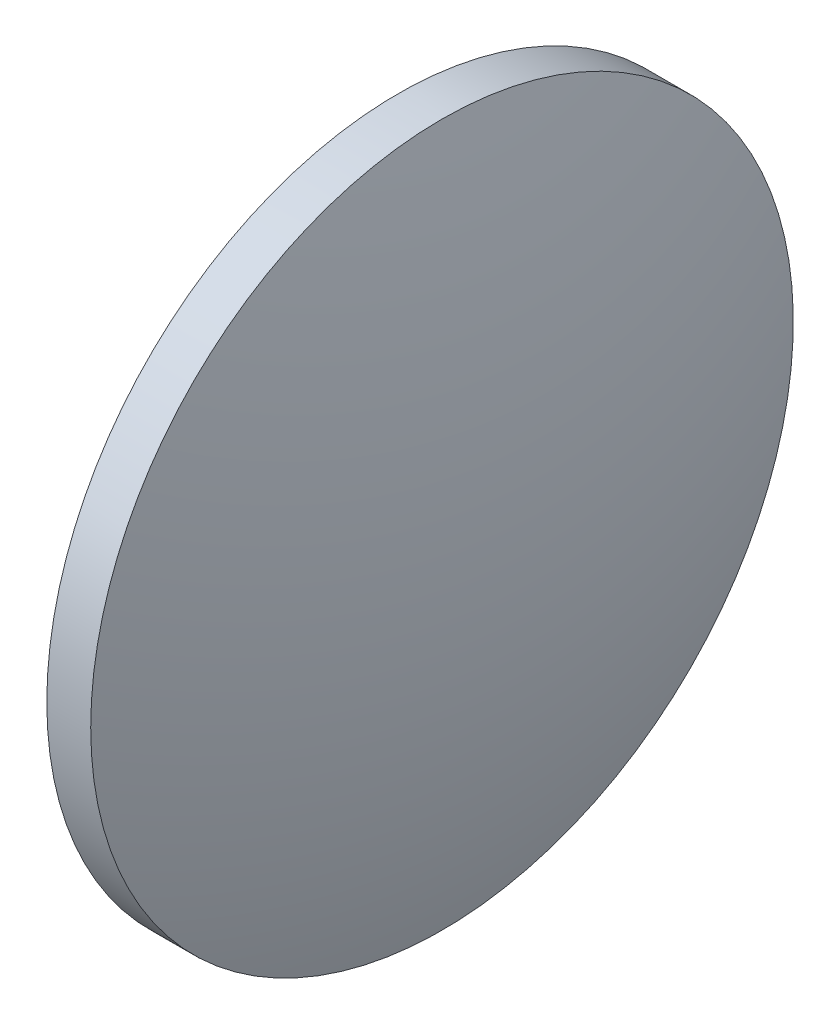
ISO-10303-21;
HEADER;
FILE_DESCRIPTION(('STEP AP214'),'2;1');
FILE_NAME('part.step','',(''),(''),'','','');
FILE_SCHEMA(('AUTOMOTIVE_DESIGN { 1 0 10303 214 1 1 1 1 }'));
ENDSEC;
DATA;
#1=APPLICATION_CONTEXT('core data for automotive mechanical design processes');
#2=APPLICATION_PROTOCOL_DEFINITION('international standard','automotive_design',2000,#1);
#3=PRODUCT_CONTEXT('',#1,'mechanical');
#4=PRODUCT('Part','Part','',(#3));
#5=PRODUCT_RELATED_PRODUCT_CATEGORY('part','',(#4));
#6=PRODUCT_DEFINITION_FORMATION('','',#4);
#7=PRODUCT_DEFINITION_CONTEXT('part definition',#1,'design');
#8=PRODUCT_DEFINITION('design','',#6,#7);
#9=PRODUCT_DEFINITION_SHAPE('','',#8);
#10=(LENGTH_UNIT() NAMED_UNIT(*) SI_UNIT(.MILLI.,.METRE.));
#11=(NAMED_UNIT(*) PLANE_ANGLE_UNIT() SI_UNIT($,.RADIAN.));
#12=(NAMED_UNIT(*) SI_UNIT($,.STERADIAN.) SOLID_ANGLE_UNIT());
#13=UNCERTAINTY_MEASURE_WITH_UNIT(LENGTH_MEASURE(1.E-05),#10,'distance_accuracy_value','');
#14=(GEOMETRIC_REPRESENTATION_CONTEXT(3) GLOBAL_UNCERTAINTY_ASSIGNED_CONTEXT((#13)) GLOBAL_UNIT_ASSIGNED_CONTEXT((#10,
#11,#12)) REPRESENTATION_CONTEXT('',''));
#15=CARTESIAN_POINT('',(0.,0.,0.));
#16=DIRECTION('',(0.,0.,1.));
#17=DIRECTION('',(1.,0.,0.));
#18=AXIS2_PLACEMENT_3D('',#15,#16,#17);
#19=CARTESIAN_POINT('',(511.149931912775,216.232675745898,0.));
#20=DIRECTION('',(-1.,0.,0.));
#21=DIRECTION('',(0.,1.,0.));
#22=AXIS2_PLACEMENT_3D('',#19,#20,#21);
#23=SPHERICAL_SURFACE('',#22,64.4830817610061);
#24=CARTESIAN_POINT('',(572.453013673781,216.232675745898,0.));
#25=DIRECTION('',(-1.,0.,0.));
#26=DIRECTION('',(0.,0.,1.));
#27=AXIS2_PLACEMENT_3D('',#24,#25,#26);
#28=CIRCLE('',#27,20.);
#29=CARTESIAN_POINT('',(572.453013673781,216.232675745898,20.));
#30=VERTEX_POINT('',#29);
#31=EDGE_CURVE('E10',#30,#30,#28,.T.);
#32=ORIENTED_EDGE('',*,*,#31,.F.);
#33=EDGE_LOOP('',(#32));
#34=FACE_BOUND('',#33,.T.);
#35=ADVANCED_FACE('F35',(#34),#23,.T.);
#36=CARTESIAN_POINT('',(560.446516354008,216.232675745898,0.));
#37=DIRECTION('',(-1.,0.,0.));
#38=DIRECTION('',(0.,0.,1.));
#39=AXIS2_PLACEMENT_3D('',#36,#37,#38);
#40=CYLINDRICAL_SURFACE('',#39,20.);
#41=CARTESIAN_POINT('',(569.953013673781,216.232675745898,0.));
#42=DIRECTION('',(-1.,0.,0.));
#43=DIRECTION('',(0.,0.,1.));
#44=AXIS2_PLACEMENT_3D('',#41,#42,#43);
#45=CIRCLE('',#44,20.);
#46=CARTESIAN_POINT('',(569.953013673781,216.232675745898,20.));
#47=VERTEX_POINT('',#46);
#48=EDGE_CURVE('E41',#47,#47,#45,.T.);
#49=ORIENTED_EDGE('',*,*,#48,.F.);
#50=EDGE_LOOP('',(#49));
#51=FACE_BOUND('',#50,.T.);
#52=ORIENTED_EDGE('',*,*,#31,.T.);
#53=EDGE_LOOP('',(#52));
#54=FACE_BOUND('',#53,.T.);
#55=ADVANCED_FACE('F49',(#51,#54),#40,.T.);
#56=CARTESIAN_POINT('',(569.953013673781,216.232675745898,0.));
#57=DIRECTION('',(1.,0.,0.));
#58=DIRECTION('',(0.,0.,-1.));
#59=AXIS2_PLACEMENT_3D('',#56,#57,#58);
#60=PLANE('',#59);
#61=ORIENTED_EDGE('',*,*,#48,.T.);
#62=EDGE_LOOP('',(#61));
#63=FACE_BOUND('',#62,.T.);
#64=ADVANCED_FACE('F47',(#63),#60,.F.);
#65=CLOSED_SHELL('',(#35,#55,#64));
#66=MANIFOLD_SOLID_BREP('B2',#65);
#67=ADVANCED_BREP_SHAPE_REPRESENTATION('',(#18,#66),#14);
#68=SHAPE_DEFINITION_REPRESENTATION(#9,#67);
ENDSEC;
END-ISO-10303-21;
